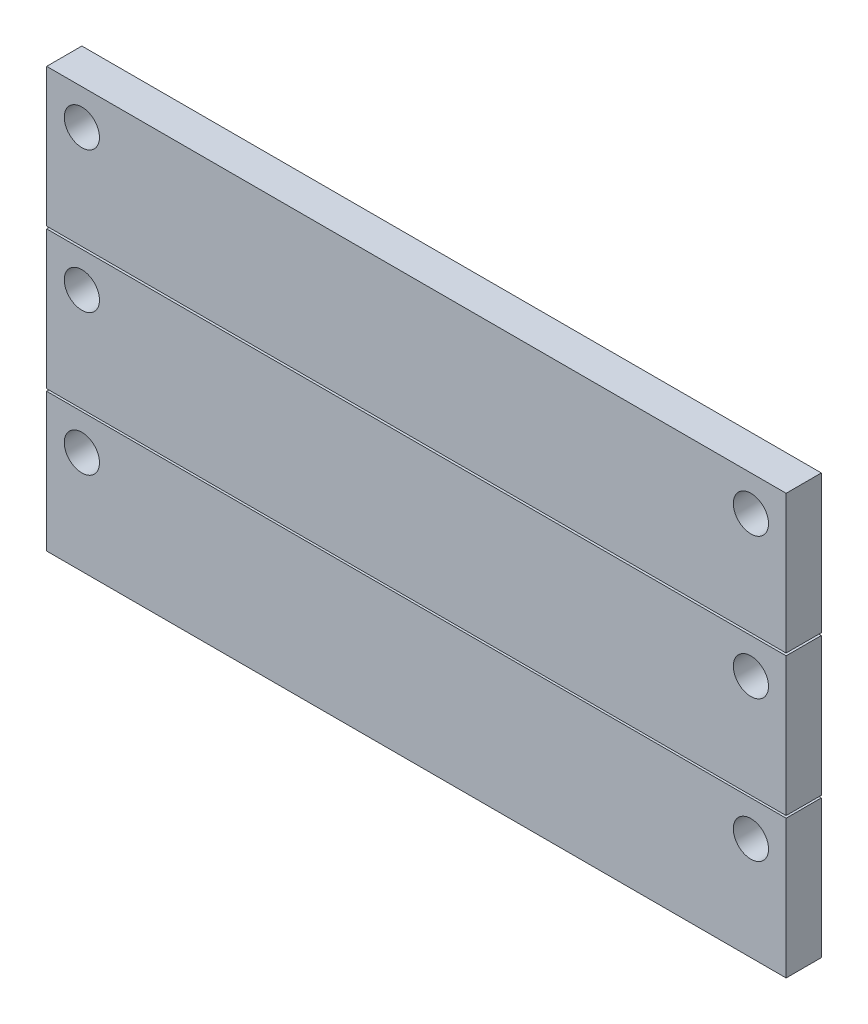
ISO-10303-21;
HEADER;
FILE_DESCRIPTION(('STEP AP214'),'2;1');
FILE_NAME('part.step','',(''),(''),'','','');
FILE_SCHEMA(('AUTOMOTIVE_DESIGN { 1 0 10303 214 1 1 1 1 }'));
ENDSEC;
DATA;
#1=APPLICATION_CONTEXT('core data for automotive mechanical design processes');
#2=APPLICATION_PROTOCOL_DEFINITION('international standard','automotive_design',2000,#1);
#3=PRODUCT_CONTEXT('',#1,'mechanical');
#4=PRODUCT('Part','Part','',(#3));
#5=PRODUCT_RELATED_PRODUCT_CATEGORY('part','',(#4));
#6=PRODUCT_DEFINITION_FORMATION('','',#4);
#7=PRODUCT_DEFINITION_CONTEXT('part definition',#1,'design');
#8=PRODUCT_DEFINITION('design','',#6,#7);
#9=PRODUCT_DEFINITION_SHAPE('','',#8);
#10=(LENGTH_UNIT() NAMED_UNIT(*) SI_UNIT(.MILLI.,.METRE.));
#11=(NAMED_UNIT(*) PLANE_ANGLE_UNIT() SI_UNIT($,.RADIAN.));
#12=(NAMED_UNIT(*) SI_UNIT($,.STERADIAN.) SOLID_ANGLE_UNIT());
#13=UNCERTAINTY_MEASURE_WITH_UNIT(LENGTH_MEASURE(1.E-05),#10,'distance_accuracy_value','');
#14=(GEOMETRIC_REPRESENTATION_CONTEXT(3) GLOBAL_UNCERTAINTY_ASSIGNED_CONTEXT((#13)) GLOBAL_UNIT_ASSIGNED_CONTEXT((#10,
#11,#12)) REPRESENTATION_CONTEXT('',''));
#15=CARTESIAN_POINT('',(0.,0.,0.));
#16=DIRECTION('',(0.,0.,1.));
#17=DIRECTION('',(1.,0.,0.));
#18=AXIS2_PLACEMENT_3D('',#15,#16,#17);
#19=CARTESIAN_POINT('',(0.,-201.267836193344,25.4));
#20=DIRECTION('',(0.,1.,0.));
#21=DIRECTION('',(0.,0.,1.));
#22=AXIS2_PLACEMENT_3D('',#19,#20,#21);
#23=PLANE('',#22);
#24=DIRECTION('',(1.,0.,0.));
#25=VECTOR('',#24,1.);
#26=CARTESIAN_POINT('',(0.,-201.267836193344,0.));
#27=LINE('',#26,#25);
#28=CARTESIAN_POINT('',(-533.4,-201.267836193344,0.));
#29=VERTEX_POINT('',#28);
#30=CARTESIAN_POINT('',(0.,-201.267836193344,0.));
#31=VERTEX_POINT('',#30);
#32=EDGE_CURVE('E115',#29,#31,#27,.T.);
#33=ORIENTED_EDGE('',*,*,#32,.T.);
#34=DIRECTION('',(0.,0.,-1.));
#35=VECTOR('',#34,1.);
#36=CARTESIAN_POINT('',(0.,-201.267836193344,25.4));
#37=LINE('',#36,#35);
#38=CARTESIAN_POINT('',(0.,-201.267836193344,25.4));
#39=VERTEX_POINT('',#38);
#40=EDGE_CURVE('E12',#39,#31,#37,.T.);
#41=ORIENTED_EDGE('',*,*,#40,.F.);
#42=DIRECTION('',(1.,0.,0.));
#43=VECTOR('',#42,1.);
#44=CARTESIAN_POINT('',(0.,-201.267836193344,25.4));
#45=LINE('',#44,#43);
#46=CARTESIAN_POINT('',(-533.4,-201.267836193344,25.4));
#47=VERTEX_POINT('',#46);
#48=EDGE_CURVE('E103',#47,#39,#45,.T.);
#49=ORIENTED_EDGE('',*,*,#48,.F.);
#50=DIRECTION('',(0.,0.,-1.));
#51=VECTOR('',#50,1.);
#52=CARTESIAN_POINT('',(-533.4,-201.267836193344,25.4));
#53=LINE('',#52,#51);
#54=EDGE_CURVE('E111',#47,#29,#53,.T.);
#55=ORIENTED_EDGE('',*,*,#54,.T.);
#56=EDGE_LOOP('',(#33,#41,#49,#55));
#57=FACE_BOUND('',#56,.T.);
#58=ADVANCED_FACE('F52',(#57),#23,.F.);
#59=CARTESIAN_POINT('',(0.,0.,25.4));
#60=DIRECTION('',(-1.,0.,0.));
#61=DIRECTION('',(0.,0.,1.));
#62=AXIS2_PLACEMENT_3D('',#59,#60,#61);
#63=PLANE('',#62);
#64=DIRECTION('',(0.,1.,0.));
#65=VECTOR('',#64,1.);
#66=CARTESIAN_POINT('',(0.,0.,0.));
#67=LINE('',#66,#65);
#68=CARTESIAN_POINT('',(0.,-101.445836193344,0.));
#69=VERTEX_POINT('',#68);
#70=EDGE_CURVE('E107',#31,#69,#67,.T.);
#71=ORIENTED_EDGE('',*,*,#70,.T.);
#72=DIRECTION('',(0.,0.,-1.));
#73=VECTOR('',#72,1.);
#74=CARTESIAN_POINT('',(0.,-101.445836193344,25.4));
#75=LINE('',#74,#73);
#76=CARTESIAN_POINT('',(0.,-101.445836193344,25.4));
#77=VERTEX_POINT('',#76);
#78=EDGE_CURVE('E60',#77,#69,#75,.T.);
#79=ORIENTED_EDGE('',*,*,#78,.F.);
#80=DIRECTION('',(0.,1.,0.));
#81=VECTOR('',#80,1.);
#82=CARTESIAN_POINT('',(0.,0.,25.4));
#83=LINE('',#82,#81);
#84=EDGE_CURVE('E98',#39,#77,#83,.T.);
#85=ORIENTED_EDGE('',*,*,#84,.F.);
#86=ORIENTED_EDGE('',*,*,#40,.T.);
#87=EDGE_LOOP('',(#71,#79,#85,#86));
#88=FACE_BOUND('',#87,.T.);
#89=ADVANCED_FACE('F106',(#88),#63,.F.);
#90=CARTESIAN_POINT('',(0.,-101.445836193344,25.4));
#91=DIRECTION('',(0.,-1.,0.));
#92=DIRECTION('',(1.,0.,0.));
#93=AXIS2_PLACEMENT_3D('',#90,#91,#92);
#94=PLANE('',#93);
#95=DIRECTION('',(-1.,0.,0.));
#96=VECTOR('',#95,1.);
#97=CARTESIAN_POINT('',(0.,-101.445836193344,0.));
#98=LINE('',#97,#96);
#99=CARTESIAN_POINT('',(-533.4,-101.445836193344,0.));
#100=VERTEX_POINT('',#99);
#101=EDGE_CURVE('E85',#69,#100,#98,.T.);
#102=ORIENTED_EDGE('',*,*,#101,.T.);
#103=DIRECTION('',(0.,0.,-1.));
#104=VECTOR('',#103,1.);
#105=CARTESIAN_POINT('',(-533.4,-101.445836193344,25.4));
#106=LINE('',#105,#104);
#107=CARTESIAN_POINT('',(-533.4,-101.445836193344,25.4));
#108=VERTEX_POINT('',#107);
#109=EDGE_CURVE('E108',#108,#100,#106,.T.);
#110=ORIENTED_EDGE('',*,*,#109,.F.);
#111=DIRECTION('',(-1.,0.,0.));
#112=VECTOR('',#111,1.);
#113=CARTESIAN_POINT('',(0.,-101.445836193344,25.4));
#114=LINE('',#113,#112);
#115=EDGE_CURVE('E101',#77,#108,#114,.T.);
#116=ORIENTED_EDGE('',*,*,#115,.F.);
#117=ORIENTED_EDGE('',*,*,#78,.T.);
#118=EDGE_LOOP('',(#102,#110,#116,#117));
#119=FACE_BOUND('',#118,.T.);
#120=ADVANCED_FACE('F109',(#119),#94,.F.);
#121=CARTESIAN_POINT('',(-533.399999999999,1.77974683336857E-12,25.4));
#122=DIRECTION('',(1.,0.,0.));
#123=DIRECTION('',(0.,1.,0.));
#124=AXIS2_PLACEMENT_3D('',#121,#122,#123);
#125=PLANE('',#124);
#126=DIRECTION('',(0.,-1.,0.));
#127=VECTOR('',#126,1.);
#128=CARTESIAN_POINT('',(-533.399999999999,1.77974683336857E-12,0.));
#129=LINE('',#128,#127);
#130=EDGE_CURVE('E91',#100,#29,#129,.T.);
#131=ORIENTED_EDGE('',*,*,#130,.T.);
#132=ORIENTED_EDGE('',*,*,#54,.F.);
#133=DIRECTION('',(0.,-1.,0.));
#134=VECTOR('',#133,1.);
#135=CARTESIAN_POINT('',(-533.399999999999,1.77974683336857E-12,25.4));
#136=LINE('',#135,#134);
#137=EDGE_CURVE('E68',#108,#47,#136,.T.);
#138=ORIENTED_EDGE('',*,*,#137,.F.);
#139=ORIENTED_EDGE('',*,*,#109,.T.);
#140=EDGE_LOOP('',(#131,#132,#138,#139));
#141=FACE_BOUND('',#140,.T.);
#142=ADVANCED_FACE('F123',(#141),#125,.F.);
#143=CARTESIAN_POINT('',(0.,0.,25.4));
#144=DIRECTION('',(0.,0.,1.));
#145=DIRECTION('',(1.,0.,0.));
#146=AXIS2_PLACEMENT_3D('',#143,#144,#145);
#147=PLANE('',#146);
#148=CARTESIAN_POINT('',(-25.4000000000007,-127.06030892801,25.4));
#149=DIRECTION('',(0.,0.,1.));
#150=DIRECTION('',(-1.,0.,0.));
#151=AXIS2_PLACEMENT_3D('',#148,#149,#150);
#152=CIRCLE('',#151,12.7);
#153=CARTESIAN_POINT('',(-38.1000000000006,-127.06030892801,25.4));
#154=VERTEX_POINT('',#153);
#155=EDGE_CURVE('E135',#154,#154,#152,.T.);
#156=ORIENTED_EDGE('',*,*,#155,.F.);
#157=EDGE_LOOP('',(#156));
#158=FACE_BOUND('',#157,.T.);
#159=CARTESIAN_POINT('',(-508.,-127.06030892801,25.4));
#160=DIRECTION('',(0.,0.,1.));
#161=DIRECTION('',(1.,0.,0.));
#162=AXIS2_PLACEMENT_3D('',#159,#160,#161);
#163=CIRCLE('',#162,12.7);
#164=CARTESIAN_POINT('',(-495.3,-127.06030892801,25.4));
#165=VERTEX_POINT('',#164);
#166=EDGE_CURVE('E129',#165,#165,#163,.T.);
#167=ORIENTED_EDGE('',*,*,#166,.F.);
#168=EDGE_LOOP('',(#167));
#169=FACE_BOUND('',#168,.T.);
#170=ORIENTED_EDGE('',*,*,#48,.T.);
#171=ORIENTED_EDGE('',*,*,#84,.T.);
#172=ORIENTED_EDGE('',*,*,#115,.T.);
#173=ORIENTED_EDGE('',*,*,#137,.T.);
#174=EDGE_LOOP('',(#170,#171,#172,#173));
#175=FACE_BOUND('',#174,.T.);
#176=ADVANCED_FACE('F99',(#158,#169,#175),#147,.T.);
#177=CARTESIAN_POINT('',(0.,0.,0.));
#178=DIRECTION('',(0.,0.,1.));
#179=DIRECTION('',(1.,0.,0.));
#180=AXIS2_PLACEMENT_3D('',#177,#178,#179);
#181=PLANE('',#180);
#182=CARTESIAN_POINT('',(-25.4000000000007,-127.06030892801,0.));
#183=DIRECTION('',(0.,0.,1.));
#184=DIRECTION('',(-1.,0.,0.));
#185=AXIS2_PLACEMENT_3D('',#182,#183,#184);
#186=CIRCLE('',#185,12.7);
#187=CARTESIAN_POINT('',(-38.1000000000006,-127.06030892801,0.));
#188=VERTEX_POINT('',#187);
#189=EDGE_CURVE('E132',#188,#188,#186,.T.);
#190=ORIENTED_EDGE('',*,*,#189,.T.);
#191=EDGE_LOOP('',(#190));
#192=FACE_BOUND('',#191,.T.);
#193=CARTESIAN_POINT('',(-508.,-127.06030892801,0.));
#194=DIRECTION('',(0.,0.,1.));
#195=DIRECTION('',(1.,0.,0.));
#196=AXIS2_PLACEMENT_3D('',#193,#194,#195);
#197=CIRCLE('',#196,12.7);
#198=CARTESIAN_POINT('',(-495.3,-127.06030892801,0.));
#199=VERTEX_POINT('',#198);
#200=EDGE_CURVE('E118',#199,#199,#197,.T.);
#201=ORIENTED_EDGE('',*,*,#200,.T.);
#202=EDGE_LOOP('',(#201));
#203=FACE_BOUND('',#202,.T.);
#204=ORIENTED_EDGE('',*,*,#32,.F.);
#205=ORIENTED_EDGE('',*,*,#130,.F.);
#206=ORIENTED_EDGE('',*,*,#101,.F.);
#207=ORIENTED_EDGE('',*,*,#70,.F.);
#208=EDGE_LOOP('',(#204,#205,#206,#207));
#209=FACE_BOUND('',#208,.T.);
#210=ADVANCED_FACE('F126',(#192,#203,#209),#181,.F.);
#211=CARTESIAN_POINT('',(-508.,-127.06030892801,0.));
#212=DIRECTION('',(0.,0.,1.));
#213=DIRECTION('',(1.,0.,0.));
#214=AXIS2_PLACEMENT_3D('',#211,#212,#213);
#215=CYLINDRICAL_SURFACE('',#214,12.7);
#216=ORIENTED_EDGE('',*,*,#200,.F.);
#217=EDGE_LOOP('',(#216));
#218=FACE_BOUND('',#217,.T.);
#219=ORIENTED_EDGE('',*,*,#166,.T.);
#220=EDGE_LOOP('',(#219));
#221=FACE_BOUND('',#220,.T.);
#222=ADVANCED_FACE('F146',(#218,#221),#215,.F.);
#223=CARTESIAN_POINT('',(-25.4000000000007,-127.06030892801,0.));
#224=DIRECTION('',(0.,0.,1.));
#225=DIRECTION('',(1.,0.,0.));
#226=AXIS2_PLACEMENT_3D('',#223,#224,#225);
#227=CYLINDRICAL_SURFACE('',#226,12.7);
#228=ORIENTED_EDGE('',*,*,#189,.F.);
#229=EDGE_LOOP('',(#228));
#230=FACE_BOUND('',#229,.T.);
#231=ORIENTED_EDGE('',*,*,#155,.T.);
#232=EDGE_LOOP('',(#231));
#233=FACE_BOUND('',#232,.T.);
#234=ADVANCED_FACE('F143',(#230,#233),#227,.F.);
#235=CLOSED_SHELL('',(#58,#89,#120,#142,#176,#210,#222,#234));
#236=MANIFOLD_SOLID_BREP('B2',#235);
#237=CARTESIAN_POINT('',(0.,-99.822,25.4));
#238=DIRECTION('',(0.,1.,0.));
#239=DIRECTION('',(0.,0.,1.));
#240=AXIS2_PLACEMENT_3D('',#237,#238,#239);
#241=PLANE('',#240);
#242=DIRECTION('',(1.,0.,0.));
#243=VECTOR('',#242,1.);
#244=CARTESIAN_POINT('',(0.,-99.822,0.));
#245=LINE('',#244,#243);
#246=CARTESIAN_POINT('',(-533.4,-99.822,0.));
#247=VERTEX_POINT('',#246);
#248=CARTESIAN_POINT('',(0.,-99.822,0.));
#249=VERTEX_POINT('',#248);
#250=EDGE_CURVE('E295',#247,#249,#245,.T.);
#251=ORIENTED_EDGE('',*,*,#250,.T.);
#252=DIRECTION('',(0.,0.,-1.));
#253=VECTOR('',#252,1.);
#254=CARTESIAN_POINT('',(0.,-99.822,25.4));
#255=LINE('',#254,#253);
#256=CARTESIAN_POINT('',(0.,-99.822,25.4));
#257=VERTEX_POINT('',#256);
#258=EDGE_CURVE('E50',#257,#249,#255,.T.);
#259=ORIENTED_EDGE('',*,*,#258,.F.);
#260=DIRECTION('',(1.,0.,0.));
#261=VECTOR('',#260,1.);
#262=CARTESIAN_POINT('',(0.,-99.822,25.4));
#263=LINE('',#262,#261);
#264=CARTESIAN_POINT('',(-533.4,-99.822,25.4));
#265=VERTEX_POINT('',#264);
#266=EDGE_CURVE('E279',#265,#257,#263,.T.);
#267=ORIENTED_EDGE('',*,*,#266,.F.);
#268=DIRECTION('',(0.,0.,-1.));
#269=VECTOR('',#268,1.);
#270=CARTESIAN_POINT('',(-533.4,-99.822,25.4));
#271=LINE('',#270,#269);
#272=EDGE_CURVE('E291',#265,#247,#271,.T.);
#273=ORIENTED_EDGE('',*,*,#272,.T.);
#274=EDGE_LOOP('',(#251,#259,#267,#273));
#275=FACE_BOUND('',#274,.T.);
#276=ADVANCED_FACE('F227',(#275),#241,.F.);
#277=CARTESIAN_POINT('',(0.,0.,25.4));
#278=DIRECTION('',(-1.,0.,0.));
#279=DIRECTION('',(0.,0.,1.));
#280=AXIS2_PLACEMENT_3D('',#277,#278,#279);
#281=PLANE('',#280);
#282=DIRECTION('',(0.,1.,0.));
#283=VECTOR('',#282,1.);
#284=CARTESIAN_POINT('',(0.,0.,0.));
#285=LINE('',#284,#283);
#286=CARTESIAN_POINT('',(0.,0.,0.));
#287=VERTEX_POINT('',#286);
#288=EDGE_CURVE('E284',#249,#287,#285,.T.);
#289=ORIENTED_EDGE('',*,*,#288,.T.);
#290=DIRECTION('',(0.,0.,-1.));
#291=VECTOR('',#290,1.);
#292=CARTESIAN_POINT('',(0.,0.,25.4));
#293=LINE('',#292,#291);
#294=CARTESIAN_POINT('',(0.,0.,25.4));
#295=VERTEX_POINT('',#294);
#296=EDGE_CURVE('E236',#295,#287,#293,.T.);
#297=ORIENTED_EDGE('',*,*,#296,.F.);
#298=DIRECTION('',(0.,1.,0.));
#299=VECTOR('',#298,1.);
#300=CARTESIAN_POINT('',(0.,0.,25.4));
#301=LINE('',#300,#299);
#302=EDGE_CURVE('E274',#257,#295,#301,.T.);
#303=ORIENTED_EDGE('',*,*,#302,.F.);
#304=ORIENTED_EDGE('',*,*,#258,.T.);
#305=EDGE_LOOP('',(#289,#297,#303,#304));
#306=FACE_BOUND('',#305,.T.);
#307=ADVANCED_FACE('F283',(#306),#281,.F.);
#308=CARTESIAN_POINT('',(0.,0.,25.4));
#309=DIRECTION('',(0.,-1.,0.));
#310=DIRECTION('',(1.,0.,0.));
#311=AXIS2_PLACEMENT_3D('',#308,#309,#310);
#312=PLANE('',#311);
#313=DIRECTION('',(-1.,0.,0.));
#314=VECTOR('',#313,1.);
#315=CARTESIAN_POINT('',(0.,0.,0.));
#316=LINE('',#315,#314);
#317=CARTESIAN_POINT('',(-533.4,0.,0.));
#318=VERTEX_POINT('',#317);
#319=EDGE_CURVE('E261',#287,#318,#316,.T.);
#320=ORIENTED_EDGE('',*,*,#319,.T.);
#321=DIRECTION('',(0.,0.,-1.));
#322=VECTOR('',#321,1.);
#323=CARTESIAN_POINT('',(-533.4,0.,25.4));
#324=LINE('',#323,#322);
#325=CARTESIAN_POINT('',(-533.4,0.,25.4));
#326=VERTEX_POINT('',#325);
#327=EDGE_CURVE('E286',#326,#318,#324,.T.);
#328=ORIENTED_EDGE('',*,*,#327,.F.);
#329=DIRECTION('',(-1.,0.,0.));
#330=VECTOR('',#329,1.);
#331=CARTESIAN_POINT('',(0.,0.,25.4));
#332=LINE('',#331,#330);
#333=EDGE_CURVE('E277',#295,#326,#332,.T.);
#334=ORIENTED_EDGE('',*,*,#333,.F.);
#335=ORIENTED_EDGE('',*,*,#296,.T.);
#336=EDGE_LOOP('',(#320,#328,#334,#335));
#337=FACE_BOUND('',#336,.T.);
#338=ADVANCED_FACE('F287',(#337),#312,.F.);
#339=CARTESIAN_POINT('',(-533.4,1.77974683336857E-12,25.4));
#340=DIRECTION('',(1.,0.,0.));
#341=DIRECTION('',(0.,1.,0.));
#342=AXIS2_PLACEMENT_3D('',#339,#340,#341);
#343=PLANE('',#342);
#344=DIRECTION('',(0.,-1.,0.));
#345=VECTOR('',#344,1.);
#346=CARTESIAN_POINT('',(-533.4,1.77974683336857E-12,0.));
#347=LINE('',#346,#345);
#348=EDGE_CURVE('E267',#318,#247,#347,.T.);
#349=ORIENTED_EDGE('',*,*,#348,.T.);
#350=ORIENTED_EDGE('',*,*,#272,.F.);
#351=DIRECTION('',(0.,-1.,0.));
#352=VECTOR('',#351,1.);
#353=CARTESIAN_POINT('',(-533.4,1.77974683336857E-12,25.4));
#354=LINE('',#353,#352);
#355=EDGE_CURVE('E244',#326,#265,#354,.T.);
#356=ORIENTED_EDGE('',*,*,#355,.F.);
#357=ORIENTED_EDGE('',*,*,#327,.T.);
#358=EDGE_LOOP('',(#349,#350,#356,#357));
#359=FACE_BOUND('',#358,.T.);
#360=ADVANCED_FACE('F309',(#359),#343,.F.);
#361=CARTESIAN_POINT('',(0.,0.,25.4));
#362=DIRECTION('',(0.,0.,1.));
#363=DIRECTION('',(1.,0.,0.));
#364=AXIS2_PLACEMENT_3D('',#361,#362,#363);
#365=PLANE('',#364);
#366=CARTESIAN_POINT('',(-25.4000000000003,-25.4603089280097,25.4));
#367=DIRECTION('',(0.,0.,1.));
#368=DIRECTION('',(-1.,0.,0.));
#369=AXIS2_PLACEMENT_3D('',#366,#367,#368);
#370=CIRCLE('',#369,12.7);
#371=CARTESIAN_POINT('',(-38.1000000000003,-25.4603089280097,25.4));
#372=VERTEX_POINT('',#371);
#373=EDGE_CURVE('E324',#372,#372,#370,.T.);
#374=ORIENTED_EDGE('',*,*,#373,.F.);
#375=EDGE_LOOP('',(#374));
#376=FACE_BOUND('',#375,.T.);
#377=CARTESIAN_POINT('',(-508.,-25.4603089280098,25.4));
#378=DIRECTION('',(0.,0.,1.));
#379=DIRECTION('',(1.,0.,0.));
#380=AXIS2_PLACEMENT_3D('',#377,#378,#379);
#381=CIRCLE('',#380,12.7);
#382=CARTESIAN_POINT('',(-495.3,-25.4603089280098,25.4));
#383=VERTEX_POINT('',#382);
#384=EDGE_CURVE('E316',#383,#383,#381,.T.);
#385=ORIENTED_EDGE('',*,*,#384,.F.);
#386=EDGE_LOOP('',(#385));
#387=FACE_BOUND('',#386,.T.);
#388=ORIENTED_EDGE('',*,*,#266,.T.);
#389=ORIENTED_EDGE('',*,*,#302,.T.);
#390=ORIENTED_EDGE('',*,*,#333,.T.);
#391=ORIENTED_EDGE('',*,*,#355,.T.);
#392=EDGE_LOOP('',(#388,#389,#390,#391));
#393=FACE_BOUND('',#392,.T.);
#394=ADVANCED_FACE('F275',(#376,#387,#393),#365,.T.);
#395=CARTESIAN_POINT('',(0.,0.,0.));
#396=DIRECTION('',(0.,0.,1.));
#397=DIRECTION('',(1.,0.,0.));
#398=AXIS2_PLACEMENT_3D('',#395,#396,#397);
#399=PLANE('',#398);
#400=CARTESIAN_POINT('',(-25.4000000000003,-25.4603089280097,0.));
#401=DIRECTION('',(0.,0.,1.));
#402=DIRECTION('',(-1.,0.,0.));
#403=AXIS2_PLACEMENT_3D('',#400,#401,#402);
#404=CIRCLE('',#403,12.7);
#405=CARTESIAN_POINT('',(-38.1000000000003,-25.4603089280097,0.));
#406=VERTEX_POINT('',#405);
#407=EDGE_CURVE('E320',#406,#406,#404,.T.);
#408=ORIENTED_EDGE('',*,*,#407,.T.);
#409=EDGE_LOOP('',(#408));
#410=FACE_BOUND('',#409,.T.);
#411=CARTESIAN_POINT('',(-508.,-25.4603089280098,0.));
#412=DIRECTION('',(0.,0.,1.));
#413=DIRECTION('',(1.,0.,0.));
#414=AXIS2_PLACEMENT_3D('',#411,#412,#413);
#415=CIRCLE('',#414,12.7);
#416=CARTESIAN_POINT('',(-495.3,-25.4603089280098,0.));
#417=VERTEX_POINT('',#416);
#418=EDGE_CURVE('E299',#417,#417,#415,.T.);
#419=ORIENTED_EDGE('',*,*,#418,.T.);
#420=EDGE_LOOP('',(#419));
#421=FACE_BOUND('',#420,.T.);
#422=ORIENTED_EDGE('',*,*,#250,.F.);
#423=ORIENTED_EDGE('',*,*,#348,.F.);
#424=ORIENTED_EDGE('',*,*,#319,.F.);
#425=ORIENTED_EDGE('',*,*,#288,.F.);
#426=EDGE_LOOP('',(#422,#423,#424,#425));
#427=FACE_BOUND('',#426,.T.);
#428=ADVANCED_FACE('F312',(#410,#421,#427),#399,.F.);
#429=CARTESIAN_POINT('',(-508.,-25.4603089280098,0.));
#430=DIRECTION('',(0.,0.,1.));
#431=DIRECTION('',(1.,0.,0.));
#432=AXIS2_PLACEMENT_3D('',#429,#430,#431);
#433=CYLINDRICAL_SURFACE('',#432,12.7);
#434=ORIENTED_EDGE('',*,*,#418,.F.);
#435=EDGE_LOOP('',(#434));
#436=FACE_BOUND('',#435,.T.);
#437=ORIENTED_EDGE('',*,*,#384,.T.);
#438=EDGE_LOOP('',(#437));
#439=FACE_BOUND('',#438,.T.);
#440=ADVANCED_FACE('F337',(#436,#439),#433,.F.);
#441=CARTESIAN_POINT('',(-25.4000000000003,-25.4603089280097,0.));
#442=DIRECTION('',(0.,0.,1.));
#443=DIRECTION('',(1.,0.,0.));
#444=AXIS2_PLACEMENT_3D('',#441,#442,#443);
#445=CYLINDRICAL_SURFACE('',#444,12.7);
#446=ORIENTED_EDGE('',*,*,#407,.F.);
#447=EDGE_LOOP('',(#446));
#448=FACE_BOUND('',#447,.T.);
#449=ORIENTED_EDGE('',*,*,#373,.T.);
#450=EDGE_LOOP('',(#449));
#451=FACE_BOUND('',#450,.T.);
#452=ADVANCED_FACE('F334',(#448,#451),#445,.F.);
#453=CLOSED_SHELL('',(#276,#307,#338,#360,#394,#428,#440,#452));
#454=MANIFOLD_SOLID_BREP('B6',#453);
#455=CARTESIAN_POINT('',(0.,1.71769107199028,25.4));
#456=DIRECTION('',(0.,1.,0.));
#457=DIRECTION('',(0.,0.,1.));
#458=AXIS2_PLACEMENT_3D('',#455,#456,#457);
#459=PLANE('',#458);
#460=DIRECTION('',(1.,0.,0.));
#461=VECTOR('',#460,1.);
#462=CARTESIAN_POINT('',(0.,1.71769107199028,0.));
#463=LINE('',#462,#461);
#464=CARTESIAN_POINT('',(-533.4,1.71769107199028,0.));
#465=VERTEX_POINT('',#464);
#466=CARTESIAN_POINT('',(0.,1.71769107199028,0.));
#467=VERTEX_POINT('',#466);
#468=EDGE_CURVE('E472',#465,#467,#463,.T.);
#469=ORIENTED_EDGE('',*,*,#468,.T.);
#470=DIRECTION('',(0.,0.,-1.));
#471=VECTOR('',#470,1.);
#472=CARTESIAN_POINT('',(0.,1.71769107199028,25.4));
#473=LINE('',#472,#471);
#474=CARTESIAN_POINT('',(0.,1.71769107199028,25.4));
#475=VERTEX_POINT('',#474);
#476=EDGE_CURVE('E225',#475,#467,#473,.T.);
#477=ORIENTED_EDGE('',*,*,#476,.F.);
#478=DIRECTION('',(1.,0.,0.));
#479=VECTOR('',#478,1.);
#480=CARTESIAN_POINT('',(0.,1.71769107199028,25.4));
#481=LINE('',#480,#479);
#482=CARTESIAN_POINT('',(-533.4,1.71769107199028,25.4));
#483=VERTEX_POINT('',#482);
#484=EDGE_CURVE('E460',#483,#475,#481,.T.);
#485=ORIENTED_EDGE('',*,*,#484,.F.);
#486=DIRECTION('',(0.,0.,-1.));
#487=VECTOR('',#486,1.);
#488=CARTESIAN_POINT('',(-533.4,1.71769107199028,25.4));
#489=LINE('',#488,#487);
#490=EDGE_CURVE('E468',#483,#465,#489,.T.);
#491=ORIENTED_EDGE('',*,*,#490,.T.);
#492=EDGE_LOOP('',(#469,#477,#485,#491));
#493=FACE_BOUND('',#492,.T.);
#494=ADVANCED_FACE('F409',(#493),#459,.F.);
#495=CARTESIAN_POINT('',(0.,0.,25.4));
#496=DIRECTION('',(-1.,0.,0.));
#497=DIRECTION('',(0.,0.,1.));
#498=AXIS2_PLACEMENT_3D('',#495,#496,#497);
#499=PLANE('',#498);
#500=DIRECTION('',(0.,1.,0.));
#501=VECTOR('',#500,1.);
#502=CARTESIAN_POINT('',(0.,0.,0.));
#503=LINE('',#502,#501);
#504=CARTESIAN_POINT('',(0.,101.53969107199,0.));
#505=VERTEX_POINT('',#504);
#506=EDGE_CURVE('E464',#467,#505,#503,.T.);
#507=ORIENTED_EDGE('',*,*,#506,.T.);
#508=DIRECTION('',(0.,0.,-1.));
#509=VECTOR('',#508,1.);
#510=CARTESIAN_POINT('',(0.,101.53969107199,25.4));
#511=LINE('',#510,#509);
#512=CARTESIAN_POINT('',(0.,101.53969107199,25.4));
#513=VERTEX_POINT('',#512);
#514=EDGE_CURVE('E417',#513,#505,#511,.T.);
#515=ORIENTED_EDGE('',*,*,#514,.F.);
#516=DIRECTION('',(0.,1.,0.));
#517=VECTOR('',#516,1.);
#518=CARTESIAN_POINT('',(0.,0.,25.4));
#519=LINE('',#518,#517);
#520=EDGE_CURVE('E455',#475,#513,#519,.T.);
#521=ORIENTED_EDGE('',*,*,#520,.F.);
#522=ORIENTED_EDGE('',*,*,#476,.T.);
#523=EDGE_LOOP('',(#507,#515,#521,#522));
#524=FACE_BOUND('',#523,.T.);
#525=ADVANCED_FACE('F463',(#524),#499,.F.);
#526=CARTESIAN_POINT('',(0.,101.53969107199,25.4));
#527=DIRECTION('',(0.,-1.,0.));
#528=DIRECTION('',(1.,0.,0.));
#529=AXIS2_PLACEMENT_3D('',#526,#527,#528);
#530=PLANE('',#529);
#531=DIRECTION('',(-1.,0.,0.));
#532=VECTOR('',#531,1.);
#533=CARTESIAN_POINT('',(0.,101.53969107199,0.));
#534=LINE('',#533,#532);
#535=CARTESIAN_POINT('',(-533.4,101.53969107199,0.));
#536=VERTEX_POINT('',#535);
#537=EDGE_CURVE('E442',#505,#536,#534,.T.);
#538=ORIENTED_EDGE('',*,*,#537,.T.);
#539=DIRECTION('',(0.,0.,-1.));
#540=VECTOR('',#539,1.);
#541=CARTESIAN_POINT('',(-533.4,101.53969107199,25.4));
#542=LINE('',#541,#540);
#543=CARTESIAN_POINT('',(-533.4,101.53969107199,25.4));
#544=VERTEX_POINT('',#543);
#545=EDGE_CURVE('E465',#544,#536,#542,.T.);
#546=ORIENTED_EDGE('',*,*,#545,.F.);
#547=DIRECTION('',(-1.,0.,0.));
#548=VECTOR('',#547,1.);
#549=CARTESIAN_POINT('',(0.,101.53969107199,25.4));
#550=LINE('',#549,#548);
#551=EDGE_CURVE('E458',#513,#544,#550,.T.);
#552=ORIENTED_EDGE('',*,*,#551,.F.);
#553=ORIENTED_EDGE('',*,*,#514,.T.);
#554=EDGE_LOOP('',(#538,#546,#552,#553));
#555=FACE_BOUND('',#554,.T.);
#556=ADVANCED_FACE('F466',(#555),#530,.F.);
#557=CARTESIAN_POINT('',(-533.4,1.77974683336857E-12,25.4));
#558=DIRECTION('',(1.,0.,0.));
#559=DIRECTION('',(0.,1.,0.));
#560=AXIS2_PLACEMENT_3D('',#557,#558,#559);
#561=PLANE('',#560);
#562=DIRECTION('',(0.,-1.,0.));
#563=VECTOR('',#562,1.);
#564=CARTESIAN_POINT('',(-533.4,1.77974683336857E-12,0.));
#565=LINE('',#564,#563);
#566=EDGE_CURVE('E448',#536,#465,#565,.T.);
#567=ORIENTED_EDGE('',*,*,#566,.T.);
#568=ORIENTED_EDGE('',*,*,#490,.F.);
#569=DIRECTION('',(0.,-1.,0.));
#570=VECTOR('',#569,1.);
#571=CARTESIAN_POINT('',(-533.4,1.77974683336857E-12,25.4));
#572=LINE('',#571,#570);
#573=EDGE_CURVE('E425',#544,#483,#572,.T.);
#574=ORIENTED_EDGE('',*,*,#573,.F.);
#575=ORIENTED_EDGE('',*,*,#545,.T.);
#576=EDGE_LOOP('',(#567,#568,#574,#575));
#577=FACE_BOUND('',#576,.T.);
#578=ADVANCED_FACE('F480',(#577),#561,.F.);
#579=CARTESIAN_POINT('',(0.,0.,25.4));
#580=DIRECTION('',(0.,0.,1.));
#581=DIRECTION('',(1.,0.,0.));
#582=AXIS2_PLACEMENT_3D('',#579,#580,#581);
#583=PLANE('',#582);
#584=CARTESIAN_POINT('',(-508.,76.1396910719902,25.4));
#585=DIRECTION('',(0.,0.,1.));
#586=DIRECTION('',(1.,0.,0.));
#587=AXIS2_PLACEMENT_3D('',#584,#585,#586);
#588=CIRCLE('',#587,12.7);
#589=CARTESIAN_POINT('',(-495.3,76.1396910719902,25.4));
#590=VERTEX_POINT('',#589);
#591=EDGE_CURVE('E492',#590,#590,#588,.T.);
#592=ORIENTED_EDGE('',*,*,#591,.F.);
#593=EDGE_LOOP('',(#592));
#594=FACE_BOUND('',#593,.T.);
#595=CARTESIAN_POINT('',(-25.4,76.1396910719903,25.4));
#596=DIRECTION('',(0.,0.,1.));
#597=DIRECTION('',(-1.,0.,0.));
#598=AXIS2_PLACEMENT_3D('',#595,#596,#597);
#599=CIRCLE('',#598,12.7);
#600=CARTESIAN_POINT('',(-38.1,76.1396910719903,25.4));
#601=VERTEX_POINT('',#600);
#602=EDGE_CURVE('E486',#601,#601,#599,.T.);
#603=ORIENTED_EDGE('',*,*,#602,.F.);
#604=EDGE_LOOP('',(#603));
#605=FACE_BOUND('',#604,.T.);
#606=ORIENTED_EDGE('',*,*,#484,.T.);
#607=ORIENTED_EDGE('',*,*,#520,.T.);
#608=ORIENTED_EDGE('',*,*,#551,.T.);
#609=ORIENTED_EDGE('',*,*,#573,.T.);
#610=EDGE_LOOP('',(#606,#607,#608,#609));
#611=FACE_BOUND('',#610,.T.);
#612=ADVANCED_FACE('F456',(#594,#605,#611),#583,.T.);
#613=CARTESIAN_POINT('',(0.,0.,0.));
#614=DIRECTION('',(0.,0.,1.));
#615=DIRECTION('',(1.,0.,0.));
#616=AXIS2_PLACEMENT_3D('',#613,#614,#615);
#617=PLANE('',#616);
#618=CARTESIAN_POINT('',(-508.,76.1396910719902,0.));
#619=DIRECTION('',(0.,0.,1.));
#620=DIRECTION('',(1.,0.,0.));
#621=AXIS2_PLACEMENT_3D('',#618,#619,#620);
#622=CIRCLE('',#621,12.7);
#623=CARTESIAN_POINT('',(-495.3,76.1396910719902,0.));
#624=VERTEX_POINT('',#623);
#625=EDGE_CURVE('E475',#624,#624,#622,.T.);
#626=ORIENTED_EDGE('',*,*,#625,.T.);
#627=EDGE_LOOP('',(#626));
#628=FACE_BOUND('',#627,.T.);
#629=CARTESIAN_POINT('',(-25.4,76.1396910719903,0.));
#630=DIRECTION('',(0.,0.,1.));
#631=DIRECTION('',(-1.,0.,0.));
#632=AXIS2_PLACEMENT_3D('',#629,#630,#631);
#633=CIRCLE('',#632,12.7);
#634=CARTESIAN_POINT('',(-38.1,76.1396910719903,0.));
#635=VERTEX_POINT('',#634);
#636=EDGE_CURVE('E489',#635,#635,#633,.T.);
#637=ORIENTED_EDGE('',*,*,#636,.T.);
#638=EDGE_LOOP('',(#637));
#639=FACE_BOUND('',#638,.T.);
#640=ORIENTED_EDGE('',*,*,#468,.F.);
#641=ORIENTED_EDGE('',*,*,#566,.F.);
#642=ORIENTED_EDGE('',*,*,#537,.F.);
#643=ORIENTED_EDGE('',*,*,#506,.F.);
#644=EDGE_LOOP('',(#640,#641,#642,#643));
#645=FACE_BOUND('',#644,.T.);
#646=ADVANCED_FACE('F483',(#628,#639,#645),#617,.F.);
#647=CARTESIAN_POINT('',(-25.4,76.1396910719903,0.));
#648=DIRECTION('',(0.,0.,1.));
#649=DIRECTION('',(1.,0.,0.));
#650=AXIS2_PLACEMENT_3D('',#647,#648,#649);
#651=CYLINDRICAL_SURFACE('',#650,12.7);
#652=ORIENTED_EDGE('',*,*,#636,.F.);
#653=EDGE_LOOP('',(#652));
#654=FACE_BOUND('',#653,.T.);
#655=ORIENTED_EDGE('',*,*,#602,.T.);
#656=EDGE_LOOP('',(#655));
#657=FACE_BOUND('',#656,.T.);
#658=ADVANCED_FACE('F503',(#654,#657),#651,.F.);
#659=CARTESIAN_POINT('',(-508.,76.1396910719902,0.));
#660=DIRECTION('',(0.,0.,1.));
#661=DIRECTION('',(1.,0.,0.));
#662=AXIS2_PLACEMENT_3D('',#659,#660,#661);
#663=CYLINDRICAL_SURFACE('',#662,12.7);
#664=ORIENTED_EDGE('',*,*,#625,.F.);
#665=EDGE_LOOP('',(#664));
#666=FACE_BOUND('',#665,.T.);
#667=ORIENTED_EDGE('',*,*,#591,.T.);
#668=EDGE_LOOP('',(#667));
#669=FACE_BOUND('',#668,.T.);
#670=ADVANCED_FACE('F500',(#666,#669),#663,.F.);
#671=CLOSED_SHELL('',(#494,#525,#556,#578,#612,#646,#658,#670));
#672=MANIFOLD_SOLID_BREP('B44',#671);
#673=ADVANCED_BREP_SHAPE_REPRESENTATION('',(#18,#236,#454,#672),#14);
#674=SHAPE_DEFINITION_REPRESENTATION(#9,#673);
ENDSEC;
END-ISO-10303-21;
